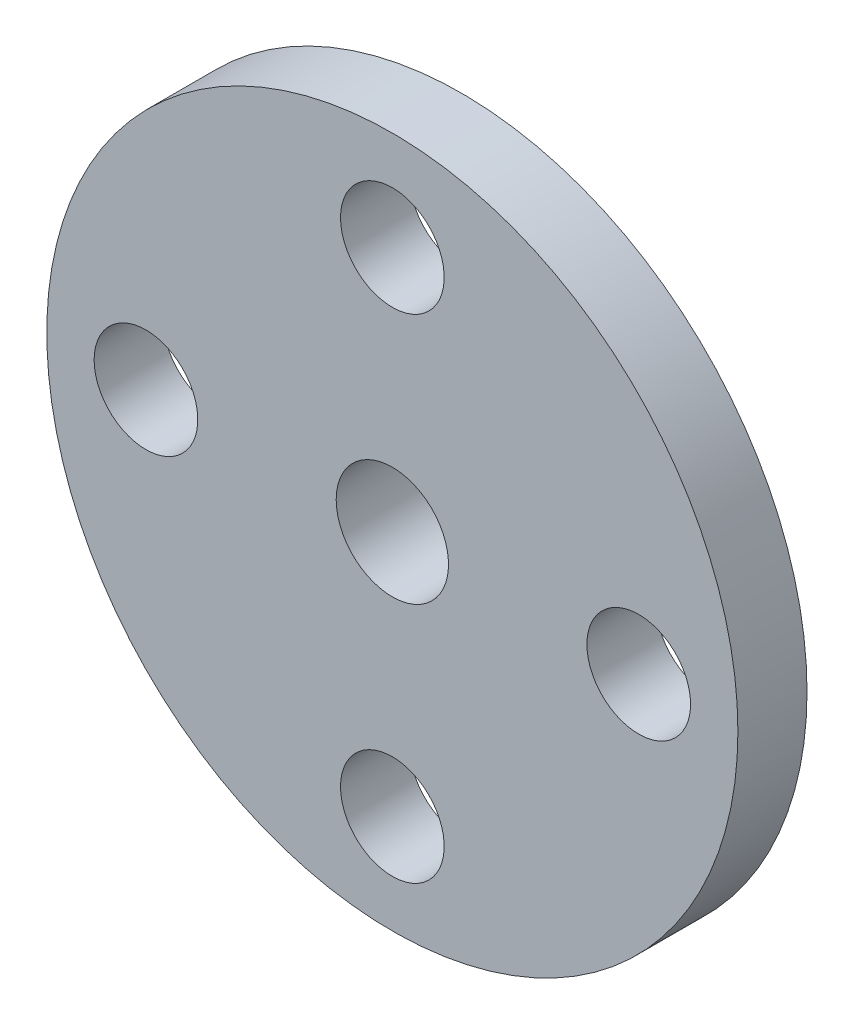
ISO-10303-21;
HEADER;
FILE_DESCRIPTION(('STEP AP214'),'2;1');
FILE_NAME('part.step','',(''),(''),'','','');
FILE_SCHEMA(('AUTOMOTIVE_DESIGN { 1 0 10303 214 1 1 1 1 }'));
ENDSEC;
DATA;
#1=APPLICATION_CONTEXT('core data for automotive mechanical design processes');
#2=APPLICATION_PROTOCOL_DEFINITION('international standard','automotive_design',2000,#1);
#3=PRODUCT_CONTEXT('',#1,'mechanical');
#4=PRODUCT('Part','Part','',(#3));
#5=PRODUCT_RELATED_PRODUCT_CATEGORY('part','',(#4));
#6=PRODUCT_DEFINITION_FORMATION('','',#4);
#7=PRODUCT_DEFINITION_CONTEXT('part definition',#1,'design');
#8=PRODUCT_DEFINITION('design','',#6,#7);
#9=PRODUCT_DEFINITION_SHAPE('','',#8);
#10=(LENGTH_UNIT() NAMED_UNIT(*) SI_UNIT(.MILLI.,.METRE.));
#11=(NAMED_UNIT(*) PLANE_ANGLE_UNIT() SI_UNIT($,.RADIAN.));
#12=(NAMED_UNIT(*) SI_UNIT($,.STERADIAN.) SOLID_ANGLE_UNIT());
#13=UNCERTAINTY_MEASURE_WITH_UNIT(LENGTH_MEASURE(1.E-05),#10,'distance_accuracy_value','');
#14=(GEOMETRIC_REPRESENTATION_CONTEXT(3) GLOBAL_UNCERTAINTY_ASSIGNED_CONTEXT((#13)) GLOBAL_UNIT_ASSIGNED_CONTEXT((#10,
#11,#12)) REPRESENTATION_CONTEXT('',''));
#15=CARTESIAN_POINT('',(0.,0.,0.));
#16=DIRECTION('',(0.,0.,1.));
#17=DIRECTION('',(1.,0.,0.));
#18=AXIS2_PLACEMENT_3D('',#15,#16,#17);
#19=CARTESIAN_POINT('',(0.,0.,2.));
#20=DIRECTION('',(0.,0.,-1.));
#21=DIRECTION('',(-1.,0.,0.));
#22=AXIS2_PLACEMENT_3D('',#19,#20,#21);
#23=CYLINDRICAL_SURFACE('',#22,10.);
#24=CARTESIAN_POINT('',(0.,0.,2.));
#25=DIRECTION('',(0.,0.,1.));
#26=DIRECTION('',(1.,0.,0.));
#27=AXIS2_PLACEMENT_3D('',#24,#25,#26);
#28=CIRCLE('',#27,10.);
#29=CARTESIAN_POINT('',(10.,0.,2.));
#30=VERTEX_POINT('',#29);
#31=EDGE_CURVE('E10',#30,#30,#28,.T.);
#32=ORIENTED_EDGE('',*,*,#31,.F.);
#33=EDGE_LOOP('',(#32));
#34=FACE_BOUND('',#33,.T.);
#35=CARTESIAN_POINT('',(0.,0.,0.));
#36=DIRECTION('',(0.,0.,1.));
#37=DIRECTION('',(1.,0.,0.));
#38=AXIS2_PLACEMENT_3D('',#35,#36,#37);
#39=CIRCLE('',#38,10.);
#40=CARTESIAN_POINT('',(10.,0.,0.));
#41=VERTEX_POINT('',#40);
#42=EDGE_CURVE('E45',#41,#41,#39,.T.);
#43=ORIENTED_EDGE('',*,*,#42,.T.);
#44=EDGE_LOOP('',(#43));
#45=FACE_BOUND('',#44,.T.);
#46=ADVANCED_FACE('F42',(#34,#45),#23,.T.);
#47=CARTESIAN_POINT('',(0.,0.,2.));
#48=DIRECTION('',(0.,0.,1.));
#49=DIRECTION('',(1.,0.,0.));
#50=AXIS2_PLACEMENT_3D('',#47,#48,#49);
#51=PLANE('',#50);
#52=CARTESIAN_POINT('',(0.,0.,2.));
#53=DIRECTION('',(0.,0.,-1.));
#54=DIRECTION('',(-1.,0.,0.));
#55=AXIS2_PLACEMENT_3D('',#52,#53,#54);
#56=CIRCLE('',#55,1.625);
#57=CARTESIAN_POINT('',(-1.625,0.,2.));
#58=VERTEX_POINT('',#57);
#59=EDGE_CURVE('E81',#58,#58,#56,.T.);
#60=ORIENTED_EDGE('',*,*,#59,.T.);
#61=EDGE_LOOP('',(#60));
#62=FACE_BOUND('',#61,.T.);
#63=CARTESIAN_POINT('',(7.13,0.,2.));
#64=DIRECTION('',(0.,0.,-1.));
#65=DIRECTION('',(-1.,0.,0.));
#66=AXIS2_PLACEMENT_3D('',#63,#64,#65);
#67=CIRCLE('',#66,1.5);
#68=CARTESIAN_POINT('',(5.63,0.,2.));
#69=VERTEX_POINT('',#68);
#70=EDGE_CURVE('E71',#69,#69,#67,.T.);
#71=ORIENTED_EDGE('',*,*,#70,.T.);
#72=EDGE_LOOP('',(#71));
#73=FACE_BOUND('',#72,.T.);
#74=CARTESIAN_POINT('',(-7.13,0.,2.));
#75=DIRECTION('',(0.,0.,-1.));
#76=DIRECTION('',(-1.,0.,0.));
#77=AXIS2_PLACEMENT_3D('',#74,#75,#76);
#78=CIRCLE('',#77,1.5);
#79=CARTESIAN_POINT('',(-8.63,0.,2.));
#80=VERTEX_POINT('',#79);
#81=EDGE_CURVE('E65',#80,#80,#78,.T.);
#82=ORIENTED_EDGE('',*,*,#81,.T.);
#83=EDGE_LOOP('',(#82));
#84=FACE_BOUND('',#83,.T.);
#85=CARTESIAN_POINT('',(0.,-7.13,2.));
#86=DIRECTION('',(0.,0.,-1.));
#87=DIRECTION('',(-1.,0.,0.));
#88=AXIS2_PLACEMENT_3D('',#85,#86,#87);
#89=CIRCLE('',#88,1.5);
#90=CARTESIAN_POINT('',(-1.5,-7.13,2.));
#91=VERTEX_POINT('',#90);
#92=EDGE_CURVE('E59',#91,#91,#89,.T.);
#93=ORIENTED_EDGE('',*,*,#92,.T.);
#94=EDGE_LOOP('',(#93));
#95=FACE_BOUND('',#94,.T.);
#96=CARTESIAN_POINT('',(0.,7.13,2.));
#97=DIRECTION('',(0.,0.,-1.));
#98=DIRECTION('',(-1.,0.,0.));
#99=AXIS2_PLACEMENT_3D('',#96,#97,#98);
#100=CIRCLE('',#99,1.5);
#101=CARTESIAN_POINT('',(-1.5,7.13,2.));
#102=VERTEX_POINT('',#101);
#103=EDGE_CURVE('E52',#102,#102,#100,.T.);
#104=ORIENTED_EDGE('',*,*,#103,.T.);
#105=EDGE_LOOP('',(#104));
#106=FACE_BOUND('',#105,.T.);
#107=ORIENTED_EDGE('',*,*,#31,.T.);
#108=EDGE_LOOP('',(#107));
#109=FACE_BOUND('',#108,.T.);
#110=ADVANCED_FACE('F90',(#62,#73,#84,#95,#106,#109),#51,.T.);
#111=CARTESIAN_POINT('',(0.,0.,0.));
#112=DIRECTION('',(0.,0.,1.));
#113=DIRECTION('',(1.,0.,0.));
#114=AXIS2_PLACEMENT_3D('',#111,#112,#113);
#115=PLANE('',#114);
#116=CARTESIAN_POINT('',(0.,0.,0.));
#117=DIRECTION('',(0.,0.,1.));
#118=DIRECTION('',(1.,0.,0.));
#119=AXIS2_PLACEMENT_3D('',#116,#117,#118);
#120=CIRCLE('',#119,4.5);
#121=CARTESIAN_POINT('',(4.5,0.,0.));
#122=VERTEX_POINT('',#121);
#123=EDGE_CURVE('E78',#122,#122,#120,.T.);
#124=ORIENTED_EDGE('',*,*,#123,.T.);
#125=EDGE_LOOP('',(#124));
#126=FACE_BOUND('',#125,.T.);
#127=CARTESIAN_POINT('',(7.13,0.,0.));
#128=DIRECTION('',(0.,0.,-1.));
#129=DIRECTION('',(-1.,0.,0.));
#130=AXIS2_PLACEMENT_3D('',#127,#128,#129);
#131=CIRCLE('',#130,1.5);
#132=CARTESIAN_POINT('',(5.63,0.,0.));
#133=VERTEX_POINT('',#132);
#134=EDGE_CURVE('E74',#133,#133,#131,.T.);
#135=ORIENTED_EDGE('',*,*,#134,.F.);
#136=EDGE_LOOP('',(#135));
#137=FACE_BOUND('',#136,.T.);
#138=CARTESIAN_POINT('',(-7.13,0.,0.));
#139=DIRECTION('',(0.,0.,-1.));
#140=DIRECTION('',(-1.,0.,0.));
#141=AXIS2_PLACEMENT_3D('',#138,#139,#140);
#142=CIRCLE('',#141,1.5);
#143=CARTESIAN_POINT('',(-8.63,0.,0.));
#144=VERTEX_POINT('',#143);
#145=EDGE_CURVE('E68',#144,#144,#142,.T.);
#146=ORIENTED_EDGE('',*,*,#145,.F.);
#147=EDGE_LOOP('',(#146));
#148=FACE_BOUND('',#147,.T.);
#149=CARTESIAN_POINT('',(0.,-7.13,0.));
#150=DIRECTION('',(0.,0.,-1.));
#151=DIRECTION('',(-1.,0.,0.));
#152=AXIS2_PLACEMENT_3D('',#149,#150,#151);
#153=CIRCLE('',#152,1.5);
#154=CARTESIAN_POINT('',(-1.5,-7.13,0.));
#155=VERTEX_POINT('',#154);
#156=EDGE_CURVE('E62',#155,#155,#153,.T.);
#157=ORIENTED_EDGE('',*,*,#156,.F.);
#158=EDGE_LOOP('',(#157));
#159=FACE_BOUND('',#158,.T.);
#160=CARTESIAN_POINT('',(0.,7.13,0.));
#161=DIRECTION('',(0.,0.,-1.));
#162=DIRECTION('',(-1.,0.,0.));
#163=AXIS2_PLACEMENT_3D('',#160,#161,#162);
#164=CIRCLE('',#163,1.5);
#165=CARTESIAN_POINT('',(-1.5,7.13,0.));
#166=VERTEX_POINT('',#165);
#167=EDGE_CURVE('E56',#166,#166,#164,.T.);
#168=ORIENTED_EDGE('',*,*,#167,.F.);
#169=EDGE_LOOP('',(#168));
#170=FACE_BOUND('',#169,.T.);
#171=ORIENTED_EDGE('',*,*,#42,.F.);
#172=EDGE_LOOP('',(#171));
#173=FACE_BOUND('',#172,.T.);
#174=ADVANCED_FACE('F112',(#126,#137,#148,#159,#170,#173),#115,.F.);
#175=CARTESIAN_POINT('',(0.,7.13,0.));
#176=DIRECTION('',(0.,0.,-1.));
#177=DIRECTION('',(-1.,0.,0.));
#178=AXIS2_PLACEMENT_3D('',#175,#176,#177);
#179=CYLINDRICAL_SURFACE('',#178,1.5);
#180=ORIENTED_EDGE('',*,*,#103,.F.);
#181=EDGE_LOOP('',(#180));
#182=FACE_BOUND('',#181,.T.);
#183=ORIENTED_EDGE('',*,*,#167,.T.);
#184=EDGE_LOOP('',(#183));
#185=FACE_BOUND('',#184,.T.);
#186=ADVANCED_FACE('F115',(#182,#185),#179,.F.);
#187=CARTESIAN_POINT('',(0.,-7.13,0.));
#188=DIRECTION('',(0.,0.,-1.));
#189=DIRECTION('',(-1.,0.,0.));
#190=AXIS2_PLACEMENT_3D('',#187,#188,#189);
#191=CYLINDRICAL_SURFACE('',#190,1.5);
#192=ORIENTED_EDGE('',*,*,#92,.F.);
#193=EDGE_LOOP('',(#192));
#194=FACE_BOUND('',#193,.T.);
#195=ORIENTED_EDGE('',*,*,#156,.T.);
#196=EDGE_LOOP('',(#195));
#197=FACE_BOUND('',#196,.T.);
#198=ADVANCED_FACE('F137',(#194,#197),#191,.F.);
#199=CARTESIAN_POINT('',(-7.13,0.,0.));
#200=DIRECTION('',(0.,0.,-1.));
#201=DIRECTION('',(-1.,0.,0.));
#202=AXIS2_PLACEMENT_3D('',#199,#200,#201);
#203=CYLINDRICAL_SURFACE('',#202,1.5);
#204=ORIENTED_EDGE('',*,*,#81,.F.);
#205=EDGE_LOOP('',(#204));
#206=FACE_BOUND('',#205,.T.);
#207=ORIENTED_EDGE('',*,*,#145,.T.);
#208=EDGE_LOOP('',(#207));
#209=FACE_BOUND('',#208,.T.);
#210=ADVANCED_FACE('F141',(#206,#209),#203,.F.);
#211=CARTESIAN_POINT('',(7.13,0.,0.));
#212=DIRECTION('',(0.,0.,-1.));
#213=DIRECTION('',(-1.,0.,0.));
#214=AXIS2_PLACEMENT_3D('',#211,#212,#213);
#215=CYLINDRICAL_SURFACE('',#214,1.5);
#216=ORIENTED_EDGE('',*,*,#70,.F.);
#217=EDGE_LOOP('',(#216));
#218=FACE_BOUND('',#217,.T.);
#219=ORIENTED_EDGE('',*,*,#134,.T.);
#220=EDGE_LOOP('',(#219));
#221=FACE_BOUND('',#220,.T.);
#222=ADVANCED_FACE('F108',(#218,#221),#215,.F.);
#223=CARTESIAN_POINT('',(0.,0.,-2.));
#224=DIRECTION('',(0.,0.,1.));
#225=DIRECTION('',(1.,0.,0.));
#226=AXIS2_PLACEMENT_3D('',#223,#224,#225);
#227=CYLINDRICAL_SURFACE('',#226,4.5);
#228=CARTESIAN_POINT('',(0.,0.,-2.));
#229=DIRECTION('',(0.,0.,1.));
#230=DIRECTION('',(1.,0.,0.));
#231=AXIS2_PLACEMENT_3D('',#228,#229,#230);
#232=CIRCLE('',#231,4.5);
#233=CARTESIAN_POINT('',(4.5,0.,-2.));
#234=VERTEX_POINT('',#233);
#235=EDGE_CURVE('E77',#234,#234,#232,.T.);
#236=ORIENTED_EDGE('',*,*,#235,.T.);
#237=EDGE_LOOP('',(#236));
#238=FACE_BOUND('',#237,.T.);
#239=ORIENTED_EDGE('',*,*,#123,.F.);
#240=EDGE_LOOP('',(#239));
#241=FACE_BOUND('',#240,.T.);
#242=ADVANCED_FACE('F102',(#238,#241),#227,.T.);
#243=CARTESIAN_POINT('',(0.,0.,-2.));
#244=DIRECTION('',(0.,0.,1.));
#245=DIRECTION('',(1.,0.,0.));
#246=AXIS2_PLACEMENT_3D('',#243,#244,#245);
#247=PLANE('',#246);
#248=CARTESIAN_POINT('',(0.,0.,-2.));
#249=DIRECTION('',(0.,0.,-1.));
#250=DIRECTION('',(-1.,0.,0.));
#251=AXIS2_PLACEMENT_3D('',#248,#249,#250);
#252=CIRCLE('',#251,1.625);
#253=CARTESIAN_POINT('',(-1.625,0.,-2.));
#254=VERTEX_POINT('',#253);
#255=EDGE_CURVE('E84',#254,#254,#252,.T.);
#256=ORIENTED_EDGE('',*,*,#255,.F.);
#257=EDGE_LOOP('',(#256));
#258=FACE_BOUND('',#257,.T.);
#259=ORIENTED_EDGE('',*,*,#235,.F.);
#260=EDGE_LOOP('',(#259));
#261=FACE_BOUND('',#260,.T.);
#262=ADVANCED_FACE('F96',(#258,#261),#247,.F.);
#263=CARTESIAN_POINT('',(0.,0.,2.));
#264=DIRECTION('',(0.,0.,-1.));
#265=DIRECTION('',(-1.,0.,0.));
#266=AXIS2_PLACEMENT_3D('',#263,#264,#265);
#267=CYLINDRICAL_SURFACE('',#266,1.625);
#268=ORIENTED_EDGE('',*,*,#59,.F.);
#269=EDGE_LOOP('',(#268));
#270=FACE_BOUND('',#269,.T.);
#271=ORIENTED_EDGE('',*,*,#255,.T.);
#272=EDGE_LOOP('',(#271));
#273=FACE_BOUND('',#272,.T.);
#274=ADVANCED_FACE('F93',(#270,#273),#267,.F.);
#275=CLOSED_SHELL('',(#46,#110,#174,#186,#198,#210,#222,#242,#262,#274));
#276=MANIFOLD_SOLID_BREP('B2',#275);
#277=ADVANCED_BREP_SHAPE_REPRESENTATION('',(#18,#276),#14);
#278=SHAPE_DEFINITION_REPRESENTATION(#9,#277);
ENDSEC;
END-ISO-10303-21;
